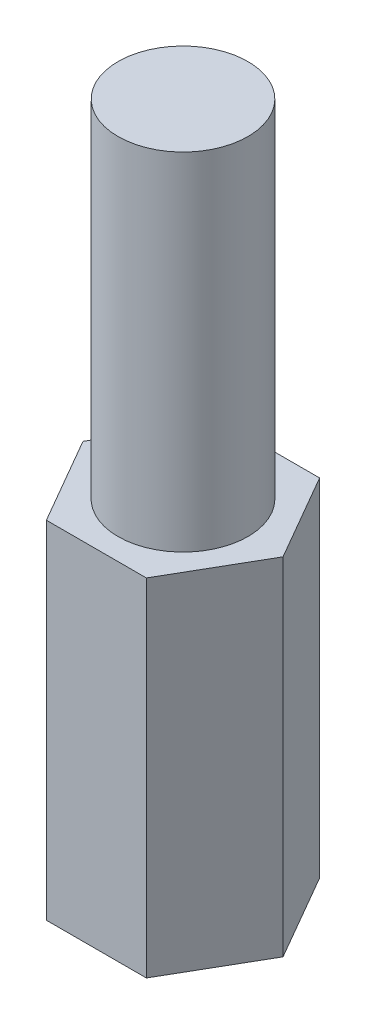
ISO-10303-21;
HEADER;
FILE_DESCRIPTION(('STEP AP214'),'2;1');
FILE_NAME('part.step','',(''),(''),'','','');
FILE_SCHEMA(('AUTOMOTIVE_DESIGN { 1 0 10303 214 1 1 1 1 }'));
ENDSEC;
DATA;
#1=APPLICATION_CONTEXT('core data for automotive mechanical design processes');
#2=APPLICATION_PROTOCOL_DEFINITION('international standard','automotive_design',2000,#1);
#3=PRODUCT_CONTEXT('',#1,'mechanical');
#4=PRODUCT('Part','Part','',(#3));
#5=PRODUCT_RELATED_PRODUCT_CATEGORY('part','',(#4));
#6=PRODUCT_DEFINITION_FORMATION('','',#4);
#7=PRODUCT_DEFINITION_CONTEXT('part definition',#1,'design');
#8=PRODUCT_DEFINITION('design','',#6,#7);
#9=PRODUCT_DEFINITION_SHAPE('','',#8);
#10=(LENGTH_UNIT() NAMED_UNIT(*) SI_UNIT(.MILLI.,.METRE.));
#11=(NAMED_UNIT(*) PLANE_ANGLE_UNIT() SI_UNIT($,.RADIAN.));
#12=(NAMED_UNIT(*) SI_UNIT($,.STERADIAN.) SOLID_ANGLE_UNIT());
#13=UNCERTAINTY_MEASURE_WITH_UNIT(LENGTH_MEASURE(1.E-05),#10,'distance_accuracy_value','');
#14=(GEOMETRIC_REPRESENTATION_CONTEXT(3) GLOBAL_UNCERTAINTY_ASSIGNED_CONTEXT((#13)) GLOBAL_UNIT_ASSIGNED_CONTEXT((#10,
#11,#12)) REPRESENTATION_CONTEXT('',''));
#15=CARTESIAN_POINT('',(0.,0.,0.));
#16=DIRECTION('',(0.,0.,1.));
#17=DIRECTION('',(1.,0.,0.));
#18=AXIS2_PLACEMENT_3D('',#15,#16,#17);
#19=CARTESIAN_POINT('',(-2.3094010767585,8.,0.));
#20=DIRECTION('',(0.866025403784439,0.,-0.5));
#21=DIRECTION('',(-0.5,0.,-0.866025403784439));
#22=AXIS2_PLACEMENT_3D('',#19,#20,#21);
#23=PLANE('',#22);
#24=DIRECTION('',(0.5,0.,0.866025403784439));
#25=VECTOR('',#24,1.);
#26=CARTESIAN_POINT('',(-2.3094010767585,0.,0.));
#27=LINE('',#26,#25);
#28=CARTESIAN_POINT('',(-2.3094010767585,0.,0.));
#29=VERTEX_POINT('',#28);
#30=CARTESIAN_POINT('',(-1.15470053837925,0.,2.));
#31=VERTEX_POINT('',#30);
#32=EDGE_CURVE('E130',#29,#31,#27,.T.);
#33=ORIENTED_EDGE('',*,*,#32,.T.);
#34=DIRECTION('',(0.,-1.,0.));
#35=VECTOR('',#34,1.);
#36=CARTESIAN_POINT('',(-1.15470053837925,8.,2.));
#37=LINE('',#36,#35);
#38=CARTESIAN_POINT('',(-1.15470053837925,8.,2.));
#39=VERTEX_POINT('',#38);
#40=EDGE_CURVE('E42',#39,#31,#37,.T.);
#41=ORIENTED_EDGE('',*,*,#40,.F.);
#42=DIRECTION('',(0.5,0.,0.866025403784439));
#43=VECTOR('',#42,1.);
#44=CARTESIAN_POINT('',(-2.3094010767585,8.,0.));
#45=LINE('',#44,#43);
#46=CARTESIAN_POINT('',(-2.3094010767585,8.,0.));
#47=VERTEX_POINT('',#46);
#48=EDGE_CURVE('E147',#47,#39,#45,.T.);
#49=ORIENTED_EDGE('',*,*,#48,.F.);
#50=DIRECTION('',(0.,-1.,0.));
#51=VECTOR('',#50,1.);
#52=CARTESIAN_POINT('',(-2.3094010767585,8.,0.));
#53=LINE('',#52,#51);
#54=EDGE_CURVE('E126',#47,#29,#53,.T.);
#55=ORIENTED_EDGE('',*,*,#54,.T.);
#56=EDGE_LOOP('',(#33,#41,#49,#55));
#57=FACE_BOUND('',#56,.T.);
#58=ADVANCED_FACE('F39',(#57),#23,.F.);
#59=CARTESIAN_POINT('',(-1.15470053837925,8.,2.));
#60=DIRECTION('',(0.,0.,-1.));
#61=DIRECTION('',(-1.,0.,0.));
#62=AXIS2_PLACEMENT_3D('',#59,#60,#61);
#63=PLANE('',#62);
#64=DIRECTION('',(1.,0.,0.));
#65=VECTOR('',#64,1.);
#66=CARTESIAN_POINT('',(-1.15470053837925,0.,2.));
#67=LINE('',#66,#65);
#68=CARTESIAN_POINT('',(1.15470053837925,0.,2.));
#69=VERTEX_POINT('',#68);
#70=EDGE_CURVE('E134',#31,#69,#67,.T.);
#71=ORIENTED_EDGE('',*,*,#70,.T.);
#72=DIRECTION('',(0.,-1.,0.));
#73=VECTOR('',#72,1.);
#74=CARTESIAN_POINT('',(1.15470053837925,8.,2.));
#75=LINE('',#74,#73);
#76=CARTESIAN_POINT('',(1.15470053837925,8.,2.));
#77=VERTEX_POINT('',#76);
#78=EDGE_CURVE('E153',#77,#69,#75,.T.);
#79=ORIENTED_EDGE('',*,*,#78,.F.);
#80=DIRECTION('',(1.,0.,0.));
#81=VECTOR('',#80,1.);
#82=CARTESIAN_POINT('',(-1.15470053837925,8.,2.));
#83=LINE('',#82,#81);
#84=EDGE_CURVE('E95',#39,#77,#83,.T.);
#85=ORIENTED_EDGE('',*,*,#84,.F.);
#86=ORIENTED_EDGE('',*,*,#40,.T.);
#87=EDGE_LOOP('',(#71,#79,#85,#86));
#88=FACE_BOUND('',#87,.T.);
#89=ADVANCED_FACE('F160',(#88),#63,.F.);
#90=CARTESIAN_POINT('',(1.15470053837925,8.,2.));
#91=DIRECTION('',(-0.866025403784439,0.,-0.5));
#92=DIRECTION('',(-0.5,0.,0.866025403784439));
#93=AXIS2_PLACEMENT_3D('',#90,#91,#92);
#94=PLANE('',#93);
#95=DIRECTION('',(0.5,0.,-0.866025403784439));
#96=VECTOR('',#95,1.);
#97=CARTESIAN_POINT('',(1.15470053837925,0.,2.));
#98=LINE('',#97,#96);
#99=CARTESIAN_POINT('',(2.3094010767585,0.,0.));
#100=VERTEX_POINT('',#99);
#101=EDGE_CURVE('E138',#69,#100,#98,.T.);
#102=ORIENTED_EDGE('',*,*,#101,.T.);
#103=DIRECTION('',(0.,-1.,0.));
#104=VECTOR('',#103,1.);
#105=CARTESIAN_POINT('',(2.3094010767585,8.,0.));
#106=LINE('',#105,#104);
#107=CARTESIAN_POINT('',(2.3094010767585,8.,0.));
#108=VERTEX_POINT('',#107);
#109=EDGE_CURVE('E119',#108,#100,#106,.T.);
#110=ORIENTED_EDGE('',*,*,#109,.F.);
#111=DIRECTION('',(0.5,0.,-0.866025403784439));
#112=VECTOR('',#111,1.);
#113=CARTESIAN_POINT('',(1.15470053837925,8.,2.));
#114=LINE('',#113,#112);
#115=EDGE_CURVE('E108',#77,#108,#114,.T.);
#116=ORIENTED_EDGE('',*,*,#115,.F.);
#117=ORIENTED_EDGE('',*,*,#78,.T.);
#118=EDGE_LOOP('',(#102,#110,#116,#117));
#119=FACE_BOUND('',#118,.T.);
#120=ADVANCED_FACE('F166',(#119),#94,.F.);
#121=CARTESIAN_POINT('',(2.3094010767585,8.,0.));
#122=DIRECTION('',(-0.866025403784438,0.,0.5));
#123=DIRECTION('',(0.5,0.,0.866025403784438));
#124=AXIS2_PLACEMENT_3D('',#121,#122,#123);
#125=PLANE('',#124);
#126=DIRECTION('',(-0.5,0.,-0.866025403784438));
#127=VECTOR('',#126,1.);
#128=CARTESIAN_POINT('',(2.3094010767585,0.,0.));
#129=LINE('',#128,#127);
#130=CARTESIAN_POINT('',(1.15470053837925,0.,-2.));
#131=VERTEX_POINT('',#130);
#132=EDGE_CURVE('E117',#100,#131,#129,.T.);
#133=ORIENTED_EDGE('',*,*,#132,.T.);
#134=DIRECTION('',(0.,-1.,0.));
#135=VECTOR('',#134,1.);
#136=CARTESIAN_POINT('',(1.15470053837925,8.,-2.));
#137=LINE('',#136,#135);
#138=CARTESIAN_POINT('',(1.15470053837925,8.,-2.));
#139=VERTEX_POINT('',#138);
#140=EDGE_CURVE('E114',#139,#131,#137,.T.);
#141=ORIENTED_EDGE('',*,*,#140,.F.);
#142=DIRECTION('',(-0.5,0.,-0.866025403784438));
#143=VECTOR('',#142,1.);
#144=CARTESIAN_POINT('',(2.3094010767585,8.,0.));
#145=LINE('',#144,#143);
#146=EDGE_CURVE('E102',#108,#139,#145,.T.);
#147=ORIENTED_EDGE('',*,*,#146,.F.);
#148=ORIENTED_EDGE('',*,*,#109,.T.);
#149=EDGE_LOOP('',(#133,#141,#147,#148));
#150=FACE_BOUND('',#149,.T.);
#151=ADVANCED_FACE('F115',(#150),#125,.F.);
#152=CARTESIAN_POINT('',(1.15470053837925,8.,-2.));
#153=DIRECTION('',(0.,0.,1.));
#154=DIRECTION('',(1.,0.,0.));
#155=AXIS2_PLACEMENT_3D('',#152,#153,#154);
#156=PLANE('',#155);
#157=DIRECTION('',(-1.,0.,0.));
#158=VECTOR('',#157,1.);
#159=CARTESIAN_POINT('',(1.15470053837925,0.,-2.));
#160=LINE('',#159,#158);
#161=CARTESIAN_POINT('',(-1.15470053837925,0.,-2.));
#162=VERTEX_POINT('',#161);
#163=EDGE_CURVE('E80',#131,#162,#160,.T.);
#164=ORIENTED_EDGE('',*,*,#163,.T.);
#165=DIRECTION('',(0.,-1.,0.));
#166=VECTOR('',#165,1.);
#167=CARTESIAN_POINT('',(-1.15470053837925,8.,-2.));
#168=LINE('',#167,#166);
#169=CARTESIAN_POINT('',(-1.15470053837925,8.,-2.));
#170=VERTEX_POINT('',#169);
#171=EDGE_CURVE('E120',#170,#162,#168,.T.);
#172=ORIENTED_EDGE('',*,*,#171,.F.);
#173=DIRECTION('',(-1.,0.,0.));
#174=VECTOR('',#173,1.);
#175=CARTESIAN_POINT('',(1.15470053837925,8.,-2.));
#176=LINE('',#175,#174);
#177=EDGE_CURVE('E106',#139,#170,#176,.T.);
#178=ORIENTED_EDGE('',*,*,#177,.F.);
#179=ORIENTED_EDGE('',*,*,#140,.T.);
#180=EDGE_LOOP('',(#164,#172,#178,#179));
#181=FACE_BOUND('',#180,.T.);
#182=ADVANCED_FACE('F122',(#181),#156,.F.);
#183=CARTESIAN_POINT('',(-1.15470053837925,8.,-2.));
#184=DIRECTION('',(0.866025403784439,0.,0.5));
#185=DIRECTION('',(0.5,0.,-0.866025403784439));
#186=AXIS2_PLACEMENT_3D('',#183,#184,#185);
#187=PLANE('',#186);
#188=DIRECTION('',(-0.5,0.,0.866025403784439));
#189=VECTOR('',#188,1.);
#190=CARTESIAN_POINT('',(-1.15470053837925,0.,-2.));
#191=LINE('',#190,#189);
#192=EDGE_CURVE('E86',#162,#29,#191,.T.);
#193=ORIENTED_EDGE('',*,*,#192,.T.);
#194=ORIENTED_EDGE('',*,*,#54,.F.);
#195=DIRECTION('',(-0.5,0.,0.866025403784439));
#196=VECTOR('',#195,1.);
#197=CARTESIAN_POINT('',(-1.15470053837925,8.,-2.));
#198=LINE('',#197,#196);
#199=EDGE_CURVE('E57',#170,#47,#198,.T.);
#200=ORIENTED_EDGE('',*,*,#199,.F.);
#201=ORIENTED_EDGE('',*,*,#171,.T.);
#202=EDGE_LOOP('',(#193,#194,#200,#201));
#203=FACE_BOUND('',#202,.T.);
#204=ADVANCED_FACE('F203',(#203),#187,.F.);
#205=CARTESIAN_POINT('',(0.,8.,0.));
#206=DIRECTION('',(0.,1.,0.));
#207=DIRECTION('',(0.,0.,1.));
#208=AXIS2_PLACEMENT_3D('',#205,#206,#207);
#209=PLANE('',#208);
#210=CARTESIAN_POINT('',(0.,8.,0.));
#211=DIRECTION('',(0.,1.,0.));
#212=DIRECTION('',(0.,0.,1.));
#213=AXIS2_PLACEMENT_3D('',#210,#211,#212);
#214=CIRCLE('',#213,1.5);
#215=CARTESIAN_POINT('',(0.,8.,1.5));
#216=VERTEX_POINT('',#215);
#217=EDGE_CURVE('E11',#216,#216,#214,.T.);
#218=ORIENTED_EDGE('',*,*,#217,.F.);
#219=EDGE_LOOP('',(#218));
#220=FACE_BOUND('',#219,.T.);
#221=ORIENTED_EDGE('',*,*,#48,.T.);
#222=ORIENTED_EDGE('',*,*,#84,.T.);
#223=ORIENTED_EDGE('',*,*,#115,.T.);
#224=ORIENTED_EDGE('',*,*,#146,.T.);
#225=ORIENTED_EDGE('',*,*,#177,.T.);
#226=ORIENTED_EDGE('',*,*,#199,.T.);
#227=EDGE_LOOP('',(#221,#222,#223,#224,#225,#226));
#228=FACE_BOUND('',#227,.T.);
#229=ADVANCED_FACE('F104',(#220,#228),#209,.T.);
#230=CARTESIAN_POINT('',(0.,0.,0.));
#231=DIRECTION('',(0.,1.,0.));
#232=DIRECTION('',(0.,0.,1.));
#233=AXIS2_PLACEMENT_3D('',#230,#231,#232);
#234=PLANE('',#233);
#235=CARTESIAN_POINT('',(0.,0.,0.));
#236=DIRECTION('',(0.,-1.,0.));
#237=DIRECTION('',(0.,0.,-1.));
#238=AXIS2_PLACEMENT_3D('',#235,#236,#237);
#239=CIRCLE('',#238,1.5);
#240=CARTESIAN_POINT('',(0.,0.,-1.5));
#241=VERTEX_POINT('',#240);
#242=EDGE_CURVE('E177',#241,#241,#239,.T.);
#243=ORIENTED_EDGE('',*,*,#242,.F.);
#244=EDGE_LOOP('',(#243));
#245=FACE_BOUND('',#244,.T.);
#246=ORIENTED_EDGE('',*,*,#32,.F.);
#247=ORIENTED_EDGE('',*,*,#192,.F.);
#248=ORIENTED_EDGE('',*,*,#163,.F.);
#249=ORIENTED_EDGE('',*,*,#132,.F.);
#250=ORIENTED_EDGE('',*,*,#101,.F.);
#251=ORIENTED_EDGE('',*,*,#70,.F.);
#252=EDGE_LOOP('',(#246,#247,#248,#249,#250,#251));
#253=FACE_BOUND('',#252,.T.);
#254=ADVANCED_FACE('F165',(#245,#253),#234,.F.);
#255=CARTESIAN_POINT('',(0.,16.,0.));
#256=DIRECTION('',(0.,-1.,0.));
#257=DIRECTION('',(0.,0.,-1.));
#258=AXIS2_PLACEMENT_3D('',#255,#256,#257);
#259=CYLINDRICAL_SURFACE('',#258,1.5);
#260=CARTESIAN_POINT('',(0.,16.,0.));
#261=DIRECTION('',(0.,1.,0.));
#262=DIRECTION('',(0.,0.,1.));
#263=AXIS2_PLACEMENT_3D('',#260,#261,#262);
#264=CIRCLE('',#263,1.5);
#265=CARTESIAN_POINT('',(0.,16.,1.5));
#266=VERTEX_POINT('',#265);
#267=EDGE_CURVE('E135',#266,#266,#264,.T.);
#268=ORIENTED_EDGE('',*,*,#267,.F.);
#269=EDGE_LOOP('',(#268));
#270=FACE_BOUND('',#269,.T.);
#271=ORIENTED_EDGE('',*,*,#217,.T.);
#272=EDGE_LOOP('',(#271));
#273=FACE_BOUND('',#272,.T.);
#274=ADVANCED_FACE('F195',(#270,#273),#259,.T.);
#275=CARTESIAN_POINT('',(0.,16.,0.));
#276=DIRECTION('',(0.,1.,0.));
#277=DIRECTION('',(0.,0.,1.));
#278=AXIS2_PLACEMENT_3D('',#275,#276,#277);
#279=PLANE('',#278);
#280=ORIENTED_EDGE('',*,*,#267,.T.);
#281=EDGE_LOOP('',(#280));
#282=FACE_BOUND('',#281,.T.);
#283=ADVANCED_FACE('F190',(#282),#279,.T.);
#284=CARTESIAN_POINT('',(0.,5.,0.));
#285=DIRECTION('',(0.,-1.,0.));
#286=DIRECTION('',(0.,0.,-1.));
#287=AXIS2_PLACEMENT_3D('',#284,#285,#286);
#288=CYLINDRICAL_SURFACE('',#287,1.5);
#289=CARTESIAN_POINT('',(0.,5.,0.));
#290=DIRECTION('',(0.,-1.,0.));
#291=DIRECTION('',(0.,0.,-1.));
#292=AXIS2_PLACEMENT_3D('',#289,#290,#291);
#293=CIRCLE('',#292,1.5);
#294=CARTESIAN_POINT('',(0.,5.,-1.5));
#295=VERTEX_POINT('',#294);
#296=EDGE_CURVE('E176',#295,#295,#293,.T.);
#297=ORIENTED_EDGE('',*,*,#296,.F.);
#298=EDGE_LOOP('',(#297));
#299=FACE_BOUND('',#298,.T.);
#300=ORIENTED_EDGE('',*,*,#242,.T.);
#301=EDGE_LOOP('',(#300));
#302=FACE_BOUND('',#301,.T.);
#303=ADVANCED_FACE('F187',(#299,#302),#288,.F.);
#304=CARTESIAN_POINT('',(0.,5.,0.));
#305=DIRECTION('',(0.,-1.,0.));
#306=DIRECTION('',(0.,0.,-1.));
#307=AXIS2_PLACEMENT_3D('',#304,#305,#306);
#308=PLANE('',#307);
#309=ORIENTED_EDGE('',*,*,#296,.T.);
#310=EDGE_LOOP('',(#309));
#311=FACE_BOUND('',#310,.T.);
#312=ADVANCED_FACE('F185',(#311),#308,.T.);
#313=CLOSED_SHELL('',(#58,#89,#120,#151,#182,#204,#229,#254,#274,#283,#303,#312));
#314=MANIFOLD_SOLID_BREP('B2',#313);
#315=ADVANCED_BREP_SHAPE_REPRESENTATION('',(#18,#314),#14);
#316=SHAPE_DEFINITION_REPRESENTATION(#9,#315);
ENDSEC;
END-ISO-10303-21;
